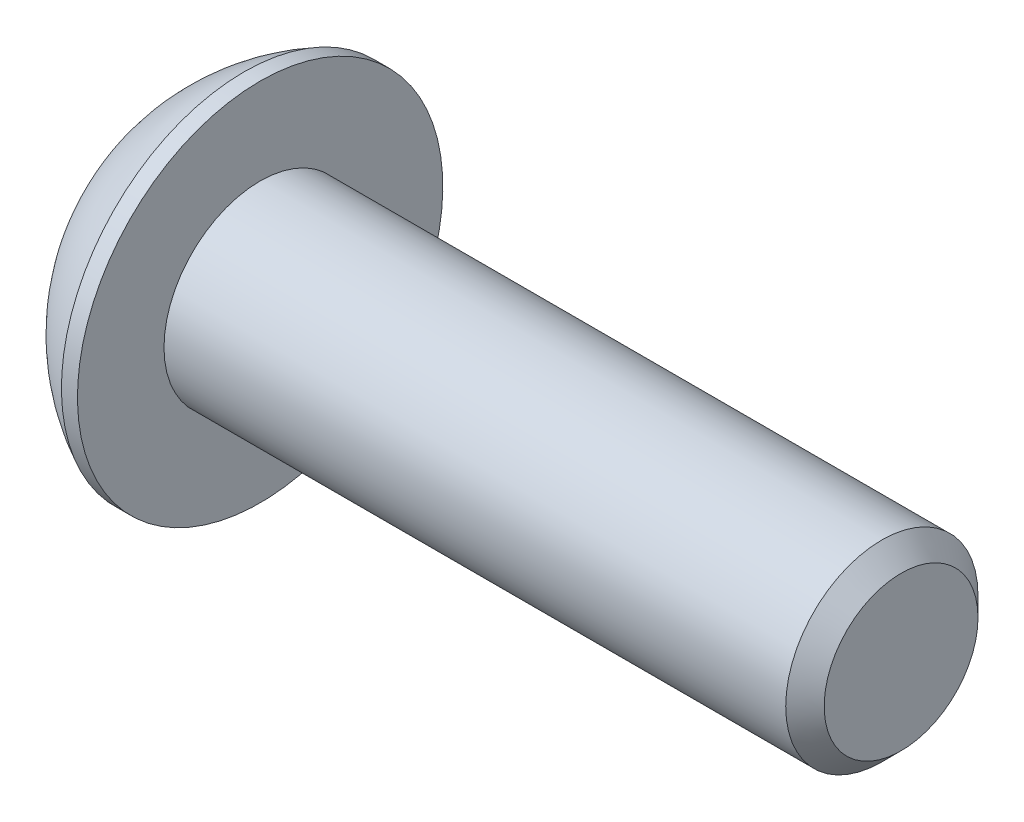
ISO-10303-21;
HEADER;
FILE_DESCRIPTION(('STEP AP214'),'2;1');
FILE_NAME('part.step','',(''),(''),'','','');
FILE_SCHEMA(('AUTOMOTIVE_DESIGN { 1 0 10303 214 1 1 1 1 }'));
ENDSEC;
DATA;
#1=APPLICATION_CONTEXT('core data for automotive mechanical design processes');
#2=APPLICATION_PROTOCOL_DEFINITION('international standard','automotive_design',2000,#1);
#3=PRODUCT_CONTEXT('',#1,'mechanical');
#4=PRODUCT('Part','Part','',(#3));
#5=PRODUCT_RELATED_PRODUCT_CATEGORY('part','',(#4));
#6=PRODUCT_DEFINITION_FORMATION('','',#4);
#7=PRODUCT_DEFINITION_CONTEXT('part definition',#1,'design');
#8=PRODUCT_DEFINITION('design','',#6,#7);
#9=PRODUCT_DEFINITION_SHAPE('','',#8);
#10=(LENGTH_UNIT() NAMED_UNIT(*) SI_UNIT(.MILLI.,.METRE.));
#11=(NAMED_UNIT(*) PLANE_ANGLE_UNIT() SI_UNIT($,.RADIAN.));
#12=(NAMED_UNIT(*) SI_UNIT($,.STERADIAN.) SOLID_ANGLE_UNIT());
#13=UNCERTAINTY_MEASURE_WITH_UNIT(LENGTH_MEASURE(1.E-05),#10,'distance_accuracy_value','');
#14=(GEOMETRIC_REPRESENTATION_CONTEXT(3) GLOBAL_UNCERTAINTY_ASSIGNED_CONTEXT((#13)) GLOBAL_UNIT_ASSIGNED_CONTEXT((#10,
#11,#12)) REPRESENTATION_CONTEXT('',''));
#15=CARTESIAN_POINT('',(0.,0.,0.));
#16=DIRECTION('',(0.,0.,1.));
#17=DIRECTION('',(1.,0.,0.));
#18=AXIS2_PLACEMENT_3D('',#15,#16,#17);
#19=CARTESIAN_POINT('',(-10.,0.,0.));
#20=DIRECTION('',(1.,0.,0.));
#21=DIRECTION('',(0.,0.,-1.));
#22=AXIS2_PLACEMENT_3D('',#19,#20,#21);
#23=CYLINDRICAL_SURFACE('',#22,1.5);
#24=CARTESIAN_POINT('',(-0.300000000000002,0.,0.));
#25=DIRECTION('',(1.,0.,0.));
#26=DIRECTION('',(0.,0.,-1.));
#27=AXIS2_PLACEMENT_3D('',#24,#25,#26);
#28=CIRCLE('',#27,1.5);
#29=CARTESIAN_POINT('',(-0.300000000000002,0.,-1.5));
#30=VERTEX_POINT('',#29);
#31=EDGE_CURVE('E45',#30,#30,#28,.F.);
#32=ORIENTED_EDGE('',*,*,#31,.T.);
#33=EDGE_LOOP('',(#32));
#34=FACE_BOUND('',#33,.T.);
#35=CARTESIAN_POINT('',(-10.,0.,0.));
#36=DIRECTION('',(1.,0.,0.));
#37=DIRECTION('',(0.,1.,0.));
#38=AXIS2_PLACEMENT_3D('',#35,#36,#37);
#39=CIRCLE('',#38,1.5);
#40=CARTESIAN_POINT('',(-10.,1.49999999999999,0.));
#41=VERTEX_POINT('',#40);
#42=EDGE_CURVE('E124',#41,#41,#39,.F.);
#43=ORIENTED_EDGE('',*,*,#42,.F.);
#44=EDGE_LOOP('',(#43));
#45=FACE_BOUND('',#44,.T.);
#46=ADVANCED_FACE('F32',(#34,#45),#23,.T.);
#47=CARTESIAN_POINT('',(0.,0.,0.));
#48=DIRECTION('',(1.,0.,0.));
#49=DIRECTION('',(0.,0.,-1.));
#50=AXIS2_PLACEMENT_3D('',#47,#48,#49);
#51=PLANE('',#50);
#52=CARTESIAN_POINT('',(0.,0.,0.));
#53=DIRECTION('',(1.,0.,0.));
#54=DIRECTION('',(0.,0.,-1.));
#55=AXIS2_PLACEMENT_3D('',#52,#53,#54);
#56=CIRCLE('',#55,1.2);
#57=CARTESIAN_POINT('',(0.,0.,-1.2));
#58=VERTEX_POINT('',#57);
#59=EDGE_CURVE('E127',#58,#58,#56,.T.);
#60=ORIENTED_EDGE('',*,*,#59,.T.);
#61=EDGE_LOOP('',(#60));
#62=FACE_BOUND('',#61,.T.);
#63=ADVANCED_FACE('F137',(#62),#51,.T.);
#64=CARTESIAN_POINT('',(0.,0.,0.));
#65=DIRECTION('',(-1.,0.,0.));
#66=DIRECTION('',(0.,0.,1.));
#67=AXIS2_PLACEMENT_3D('',#64,#65,#66);
#68=CONICAL_SURFACE('',#67,1.2,0.785398163397447);
#69=ORIENTED_EDGE('',*,*,#31,.F.);
#70=EDGE_LOOP('',(#69));
#71=FACE_BOUND('',#70,.T.);
#72=ORIENTED_EDGE('',*,*,#59,.F.);
#73=EDGE_LOOP('',(#72));
#74=FACE_BOUND('',#73,.T.);
#75=ADVANCED_FACE('F34',(#71,#74),#68,.T.);
#76=CARTESIAN_POINT('',(-11.65,0.,0.));
#77=DIRECTION('',(-1.,0.,0.));
#78=DIRECTION('',(0.,-1.,0.));
#79=AXIS2_PLACEMENT_3D('',#76,#77,#78);
#80=PLANE('',#79);
#81=CARTESIAN_POINT('',(-11.65,0.,0.));
#82=DIRECTION('',(-1.,0.,0.));
#83=DIRECTION('',(0.,-1.,0.));
#84=AXIS2_PLACEMENT_3D('',#81,#82,#83);
#85=CIRCLE('',#84,1.20470053837925);
#86=CARTESIAN_POINT('',(-11.65,-1.20470053837926,0.));
#87=VERTEX_POINT('',#86);
#88=EDGE_CURVE('E241',#87,#87,#85,.T.);
#89=ORIENTED_EDGE('',*,*,#88,.F.);
#90=EDGE_LOOP('',(#89));
#91=FACE_BOUND('',#90,.T.);
#92=CARTESIAN_POINT('',(-11.65,0.,0.));
#93=DIRECTION('',(1.,0.,0.));
#94=DIRECTION('',(0.,1.,0.));
#95=AXIS2_PLACEMENT_3D('',#92,#93,#94);
#96=CIRCLE('',#95,1.5);
#97=CARTESIAN_POINT('',(-11.65,1.5,0.));
#98=VERTEX_POINT('',#97);
#99=EDGE_CURVE('E121',#98,#98,#96,.T.);
#100=ORIENTED_EDGE('',*,*,#99,.F.);
#101=EDGE_LOOP('',(#100));
#102=FACE_BOUND('',#101,.T.);
#103=ADVANCED_FACE('F136',(#91,#102),#80,.T.);
#104=CARTESIAN_POINT('',(-8.85267857142857,0.,0.));
#105=DIRECTION('',(1.,0.,0.));
#106=DIRECTION('',(0.,1.,0.));
#107=AXIS2_PLACEMENT_3D('',#104,#105,#106);
#108=SPHERICAL_SURFACE('',#107,3.17411517981703);
#109=ORIENTED_EDGE('',*,*,#99,.T.);
#110=EDGE_LOOP('',(#109));
#111=FACE_BOUND('',#110,.T.);
#112=CARTESIAN_POINT('',(-10.25,0.,0.));
#113=DIRECTION('',(1.,0.,0.));
#114=DIRECTION('',(0.,1.,0.));
#115=AXIS2_PLACEMENT_3D('',#112,#113,#114);
#116=CIRCLE('',#115,2.85);
#117=CARTESIAN_POINT('',(-10.25,2.85,0.));
#118=VERTEX_POINT('',#117);
#119=EDGE_CURVE('E118',#118,#118,#116,.T.);
#120=ORIENTED_EDGE('',*,*,#119,.F.);
#121=EDGE_LOOP('',(#120));
#122=FACE_BOUND('',#121,.T.);
#123=ADVANCED_FACE('F148',(#111,#122),#108,.T.);
#124=CARTESIAN_POINT('',(-10.,0.,0.));
#125=DIRECTION('',(1.,0.,0.));
#126=DIRECTION('',(0.,1.,0.));
#127=AXIS2_PLACEMENT_3D('',#124,#125,#126);
#128=CYLINDRICAL_SURFACE('',#127,2.85);
#129=ORIENTED_EDGE('',*,*,#119,.T.);
#130=EDGE_LOOP('',(#129));
#131=FACE_BOUND('',#130,.T.);
#132=CARTESIAN_POINT('',(-10.,0.,0.));
#133=DIRECTION('',(1.,0.,0.));
#134=DIRECTION('',(0.,1.,0.));
#135=AXIS2_PLACEMENT_3D('',#132,#133,#134);
#136=CIRCLE('',#135,2.85);
#137=CARTESIAN_POINT('',(-10.,2.85,0.));
#138=VERTEX_POINT('',#137);
#139=EDGE_CURVE('E115',#138,#138,#136,.T.);
#140=ORIENTED_EDGE('',*,*,#139,.F.);
#141=EDGE_LOOP('',(#140));
#142=FACE_BOUND('',#141,.T.);
#143=ADVANCED_FACE('F152',(#131,#142),#128,.T.);
#144=CARTESIAN_POINT('',(-10.,2.85,0.));
#145=DIRECTION('',(1.,0.,0.));
#146=DIRECTION('',(0.,1.,0.));
#147=AXIS2_PLACEMENT_3D('',#144,#145,#146);
#148=PLANE('',#147);
#149=ORIENTED_EDGE('',*,*,#42,.T.);
#150=EDGE_LOOP('',(#149));
#151=FACE_BOUND('',#150,.T.);
#152=ORIENTED_EDGE('',*,*,#139,.T.);
#153=EDGE_LOOP('',(#152));
#154=FACE_BOUND('',#153,.T.);
#155=ADVANCED_FACE('F156',(#151,#154),#148,.T.);
#156=CARTESIAN_POINT('',(-11.65,0.,0.));
#157=DIRECTION('',(-1.,0.,0.));
#158=DIRECTION('',(0.,-1.,0.));
#159=AXIS2_PLACEMENT_3D('',#156,#157,#158);
#160=CONICAL_SURFACE('',#159,1.20470053837925,0.78539816339745);
#161=ORIENTED_EDGE('',*,*,#88,.T.);
#162=EDGE_LOOP('',(#161));
#163=FACE_BOUND('',#162,.T.);
#164=CARTESIAN_POINT('',(-12.0125645579163,-1.20678079288096,1.));
#165=CARTESIAN_POINT('',(-11.9901238799752,-1.17763239380938,1.));
#166=CARTESIAN_POINT('',(-11.9678867609271,-1.14832777655038,1.));
#167=CARTESIAN_POINT('',(-11.9239053230859,-1.0893407399734,1.));
#168=CARTESIAN_POINT('',(-11.902161120887,-1.05965823380996,1.));
#169=CARTESIAN_POINT('',(-11.8374858802222,-0.969511619364381,1.));
#170=CARTESIAN_POINT('',(-11.795456442765,-0.908390032886411,1.));
#171=CARTESIAN_POINT('',(-11.7124203349119,-0.779849899214036,1.));
#172=CARTESIAN_POINT('',(-11.6716484956871,-0.712278047733964,1.));
#173=CARTESIAN_POINT('',(-11.5967056855402,-0.573692441836181,1.));
#174=CARTESIAN_POINT('',(-11.5625124208036,-0.502691370033592,1.));
#175=CARTESIAN_POINT('',(-11.5206648240494,-0.39663310848367,1.));
#176=CARTESIAN_POINT('',(-11.5087524246011,-0.363265114723099,1.));
#177=CARTESIAN_POINT('',(-11.4876010580815,-0.295675144863695,1.));
#178=CARTESIAN_POINT('',(-11.4783622608543,-0.261453114661035,1.));
#179=CARTESIAN_POINT('',(-11.4632108375931,-0.192964714439429,1.));
#180=CARTESIAN_POINT('',(-11.4572372079353,-0.158712062702433,1.));
#181=CARTESIAN_POINT('',(-11.4487381792859,-0.0897678989597906,1.));
#182=CARTESIAN_POINT('',(-11.4462131691607,-0.0550763379077923,1.));
#183=CARTESIAN_POINT('',(-11.4448308242394,0.0128534343371999,1.));
#184=CARTESIAN_POINT('',(-11.4458171333425,0.0460884918414653,1.));
#185=CARTESIAN_POINT('',(-11.4510428296463,0.112288777523353,1.));
#186=CARTESIAN_POINT('',(-11.4552814228284,0.145254069576925,1.));
#187=CARTESIAN_POINT('',(-11.4668431932388,0.211252641710471,1.));
#188=CARTESIAN_POINT('',(-11.4742213991969,0.244276126106415,1.));
#189=CARTESIAN_POINT('',(-11.4916537633013,0.309593416178904,1.));
#190=CARTESIAN_POINT('',(-11.5017077720937,0.341887262472134,1.));
#191=CARTESIAN_POINT('',(-11.5364692676108,0.441188556116712,1.));
#192=CARTESIAN_POINT('',(-11.5650343603337,0.506841480843483,1.));
#193=CARTESIAN_POINT('',(-11.6286033694253,0.63508138921237,1.));
#194=CARTESIAN_POINT('',(-11.663629955309,0.69765656406953,1.));
#195=CARTESIAN_POINT('',(-11.7359546107891,0.81727436969462,1.));
#196=CARTESIAN_POINT('',(-11.7730556162911,0.874437672313588,1.));
#197=CARTESIAN_POINT('',(-11.8304371678966,0.958655710303492,1.));
#198=CARTESIAN_POINT('',(-11.8497720189249,0.986366163766959,1.));
#199=CARTESIAN_POINT('',(-11.8889602713879,1.0414069197441,1.));
#200=CARTESIAN_POINT('',(-11.908813529201,1.06873732439882,1.));
#201=CARTESIAN_POINT('',(-11.92888195229,1.0959092145887,1.));
#202=B_SPLINE_CURVE_WITH_KNOTS('',3,(#164,#165,#166,#167,#168,#169,#170,#171,#172,#173,#174,
#175,#176,#177,#178,#179,#180,#181,#182,#183,#184,#185,#186,#187,#188,#189,#190,#191,#192,#193,
#194,#195,#196,#197,#198,#199,#200,#201),.UNSPECIFIED.,.F.,.F.,(4,2,2,2,2,2,2,2,2,2,2,2,2,2,2,2,
2,2,4),(0.,0.110355487284534,0.220736811203825,0.443178348562911,0.679759335181116,
0.915523888816462,1.02172703810024,1.1279369325962,1.23208803653002,1.33625088357217,
1.43583459192535,1.53539399546241,1.63677534642523,1.73815103982915,1.95232008261278,
2.16725532249797,2.37159620059983,2.47295962852456,2.57429526618464),.UNSPECIFIED.);
#203=CARTESIAN_POINT('',(-11.6,-0.577350269189633,1.));
#204=VERTEX_POINT('',#203);
#205=CARTESIAN_POINT('',(-11.6,0.57735026918962,1.));
#206=VERTEX_POINT('',#205);
#207=EDGE_CURVE('E99',#204,#206,#202,.T.);
#208=ORIENTED_EDGE('',*,*,#207,.F.);
#209=CARTESIAN_POINT('',(-11.6001154873726,-1.1548160084331,-0.000200000000000086));
#210=CARTESIAN_POINT('',(-11.5802779308257,-1.13496520795026,0.0341825950071808));
#211=CARTESIAN_POINT('',(-11.5616050206389,-1.11478247255943,0.069140118139825));
#212=CARTESIAN_POINT('',(-11.5274147427232,-1.0736273952922,0.14042280295609));
#213=CARTESIAN_POINT('',(-11.5119164090235,-1.0526511355808,0.176754750528984));
#214=CARTESIAN_POINT('',(-11.4853673071423,-1.01035337909804,0.250016613803311));
#215=CARTESIAN_POINT('',(-11.4742497739969,-0.989042666109248,0.286927851445414));
#216=CARTESIAN_POINT('',(-11.4571198657762,-0.945952199282699,0.361562729310858));
#217=CARTESIAN_POINT('',(-11.4510946974667,-0.924173762626604,0.399284088108635));
#218=CARTESIAN_POINT('',(-11.4456605549675,-0.886641312640022,0.464292198417933));
#219=CARTESIAN_POINT('',(-11.4448569383167,-0.870936130672283,0.491494371528171));
#220=CARTESIAN_POINT('',(-11.4462066994169,-0.839556179862856,0.545846040669111));
#221=CARTESIAN_POINT('',(-11.4483607295472,-0.823881418494931,0.572995523754875));
#222=CARTESIAN_POINT('',(-11.4591169721285,-0.777080970599374,0.654056277326959));
#223=CARTESIAN_POINT('',(-11.4720145564154,-0.746188191116438,0.707564140978427));
#224=CARTESIAN_POINT('',(-11.5031407306022,-0.691968116419657,0.801476065143431));
#225=CARTESIAN_POINT('',(-11.5197377977018,-0.668386557293379,0.842320523671833));
#226=CARTESIAN_POINT('',(-11.5571249246853,-0.622147085933689,0.922409637381943));
#227=CARTESIAN_POINT('',(-11.5779013418174,-0.599486449584583,0.961659010870437));
#228=CARTESIAN_POINT('',(-11.6001154873726,-0.577234799135795,1.0002));
#229=B_SPLINE_CURVE_WITH_KNOTS('',3,(#209,#210,#211,#212,#213,#214,#215,#216,#217,#218,#219,
#220,#221,#222,#223,#224,#225,#226,#227,#228),.UNSPECIFIED.,.F.,.F.,(4,2,2,2,2,2,2,2,2,4),(0.,
0.133237676828559,0.26725222983449,0.399137076269299,0.530689603280767,0.624814864263845,
0.718960890149132,0.907306626112096,1.05710100361789,1.20641411519286),.UNSPECIFIED.);
#230=CARTESIAN_POINT('',(-11.6,-1.15470053837926,0.));
#231=VERTEX_POINT('',#230);
#232=EDGE_CURVE('E198',#231,#204,#229,.T.);
#233=ORIENTED_EDGE('',*,*,#232,.F.);
#234=CARTESIAN_POINT('',(-11.6001154873726,-0.577234799135795,-1.0002));
#235=CARTESIAN_POINT('',(-11.5802779308257,-0.597085599618629,-0.965817404992819));
#236=CARTESIAN_POINT('',(-11.5616050206389,-0.617268335009463,-0.930859881860175));
#237=CARTESIAN_POINT('',(-11.5274147427232,-0.658423412276693,-0.85957719704391));
#238=CARTESIAN_POINT('',(-11.5119164090235,-0.679399671988087,-0.823245249471016));
#239=CARTESIAN_POINT('',(-11.4853673071423,-0.721697428470853,-0.749983386196689));
#240=CARTESIAN_POINT('',(-11.4742497739969,-0.743008141459643,-0.713072148554586));
#241=CARTESIAN_POINT('',(-11.4571198657762,-0.786098608286193,-0.638437270689141));
#242=CARTESIAN_POINT('',(-11.4510946974667,-0.807877044942288,-0.600715911891365));
#243=CARTESIAN_POINT('',(-11.4456605549675,-0.845409494928869,-0.535707801582067));
#244=CARTESIAN_POINT('',(-11.4448569383167,-0.861114676896608,-0.508505628471829));
#245=CARTESIAN_POINT('',(-11.4462066994169,-0.892494627706036,-0.454153959330889));
#246=CARTESIAN_POINT('',(-11.4483607295472,-0.90816938907396,-0.427004476245125));
#247=CARTESIAN_POINT('',(-11.4591169721285,-0.954969836969517,-0.34594372267304));
#248=CARTESIAN_POINT('',(-11.4720145564154,-0.985862616452454,-0.292435859021573));
#249=CARTESIAN_POINT('',(-11.5031407306022,-1.04008269114923,-0.198523934856569));
#250=CARTESIAN_POINT('',(-11.5197377977018,-1.06366425027551,-0.157679476328166));
#251=CARTESIAN_POINT('',(-11.5571249246853,-1.1099037216352,-0.0775903626180562));
#252=CARTESIAN_POINT('',(-11.5779013418174,-1.13256435798431,-0.0383409891295623));
#253=CARTESIAN_POINT('',(-11.6001154873726,-1.1548160084331,0.000199999999999825));
#254=B_SPLINE_CURVE_WITH_KNOTS('',3,(#234,#235,#236,#237,#238,#239,#240,#241,#242,#243,#244,
#245,#246,#247,#248,#249,#250,#251,#252,#253),.UNSPECIFIED.,.F.,.F.,(4,2,2,2,2,2,2,2,2,4),(0.,
0.133237676828559,0.267252229834489,0.399137076269299,0.530689603280767,0.624814864263845,
0.718960890149132,0.907306626112096,1.05710100361789,1.20641411519286),.UNSPECIFIED.);
#255=CARTESIAN_POINT('',(-11.6,-0.577350269189633,-1.));
#256=VERTEX_POINT('',#255);
#257=EDGE_CURVE('E193',#256,#231,#254,.T.);
#258=ORIENTED_EDGE('',*,*,#257,.F.);
#259=CARTESIAN_POINT('',(-12.0125645579163,-1.20678079288096,-1.));
#260=CARTESIAN_POINT('',(-11.9901238799752,-1.17763239380938,-1.));
#261=CARTESIAN_POINT('',(-11.9678867609271,-1.14832777655038,-1.));
#262=CARTESIAN_POINT('',(-11.9239053230859,-1.0893407399734,-1.));
#263=CARTESIAN_POINT('',(-11.902161120887,-1.05965823380996,-1.));
#264=CARTESIAN_POINT('',(-11.8374858802222,-0.969511619364381,-1.));
#265=CARTESIAN_POINT('',(-11.795456442765,-0.908390032886411,-1.));
#266=CARTESIAN_POINT('',(-11.7124203349119,-0.779849899214036,-1.));
#267=CARTESIAN_POINT('',(-11.6716484956871,-0.712278047733964,-1.));
#268=CARTESIAN_POINT('',(-11.5967056855402,-0.573692441836181,-1.));
#269=CARTESIAN_POINT('',(-11.5625124208036,-0.502691370033592,-1.));
#270=CARTESIAN_POINT('',(-11.5206648240494,-0.39663310848367,-1.));
#271=CARTESIAN_POINT('',(-11.5087524246011,-0.363265114723098,-1.));
#272=CARTESIAN_POINT('',(-11.4876010580815,-0.295675144863695,-1.));
#273=CARTESIAN_POINT('',(-11.4783622608543,-0.261453114661034,-1.));
#274=CARTESIAN_POINT('',(-11.4632108375931,-0.192964714439429,-1.));
#275=CARTESIAN_POINT('',(-11.4572372079353,-0.158712062702433,-1.));
#276=CARTESIAN_POINT('',(-11.4487381792859,-0.0897678989597913,-1.));
#277=CARTESIAN_POINT('',(-11.4462131691607,-0.0550763379077931,-1.));
#278=CARTESIAN_POINT('',(-11.4448308242394,0.0128534343371989,-1.));
#279=CARTESIAN_POINT('',(-11.4458171333425,0.0460884918414642,-1.));
#280=CARTESIAN_POINT('',(-11.4510428296463,0.112288777523352,-1.));
#281=CARTESIAN_POINT('',(-11.4552814228284,0.145254069576924,-1.));
#282=CARTESIAN_POINT('',(-11.4668431932388,0.211252641710471,-1.));
#283=CARTESIAN_POINT('',(-11.4742213991969,0.244276126106414,-1.));
#284=CARTESIAN_POINT('',(-11.4916537633013,0.309593416178904,-1.));
#285=CARTESIAN_POINT('',(-11.5017077720937,0.341887262472134,-1.));
#286=CARTESIAN_POINT('',(-11.5364692676108,0.441188556116712,-1.));
#287=CARTESIAN_POINT('',(-11.5650343603337,0.506841480843484,-1.));
#288=CARTESIAN_POINT('',(-11.6286033694253,0.63508138921237,-1.));
#289=CARTESIAN_POINT('',(-11.663629955309,0.69765656406953,-1.));
#290=CARTESIAN_POINT('',(-11.7359546107891,0.81727436969462,-1.));
#291=CARTESIAN_POINT('',(-11.7730556162911,0.874437672313588,-1.));
#292=CARTESIAN_POINT('',(-11.8304371678966,0.958655710303492,-1.));
#293=CARTESIAN_POINT('',(-11.8497720189249,0.986366163766959,-1.));
#294=CARTESIAN_POINT('',(-11.8889602713879,1.0414069197441,-1.));
#295=CARTESIAN_POINT('',(-11.908813529201,1.06873732439882,-1.));
#296=CARTESIAN_POINT('',(-11.92888195229,1.0959092145887,-1.));
#297=B_SPLINE_CURVE_WITH_KNOTS('',3,(#259,#260,#261,#262,#263,#264,#265,#266,#267,#268,#269,
#270,#271,#272,#273,#274,#275,#276,#277,#278,#279,#280,#281,#282,#283,#284,#285,#286,#287,#288,
#289,#290,#291,#292,#293,#294,#295,#296),.UNSPECIFIED.,.F.,.F.,(4,2,2,2,2,2,2,2,2,2,2,2,2,2,2,2,
2,2,4),(0.,0.110355487284535,0.220736811203825,0.443178348562912,0.679759335181115,
0.915523888816463,1.02172703810025,1.1279369325962,1.23208803653002,1.33625088357217,
1.43583459192535,1.53539399546241,1.63677534642523,1.73815103982915,1.95232008261278,
2.16725532249797,2.37159620059983,2.47295962852456,2.57429526618464),.UNSPECIFIED.);
#298=CARTESIAN_POINT('',(-11.6,0.577350269189619,-1.));
#299=VERTEX_POINT('',#298);
#300=EDGE_CURVE('E52',#299,#256,#297,.F.);
#301=ORIENTED_EDGE('',*,*,#300,.F.);
#302=CARTESIAN_POINT('',(-11.6001154873726,1.15481600843308,0.000199999999999967));
#303=CARTESIAN_POINT('',(-11.5802779308257,1.13496520795025,-0.0341825950071808));
#304=CARTESIAN_POINT('',(-11.5616050206389,1.11478247255941,-0.0691401181398251));
#305=CARTESIAN_POINT('',(-11.5274147427232,1.07362739529218,-0.14042280295609));
#306=CARTESIAN_POINT('',(-11.5119164090235,1.05265113558079,-0.176754750528985));
#307=CARTESIAN_POINT('',(-11.4853673071423,1.01035337909802,-0.250016613803313));
#308=CARTESIAN_POINT('',(-11.4742497739969,0.989042666109233,-0.286927851445416));
#309=CARTESIAN_POINT('',(-11.4571198657762,0.945952199282684,-0.361562729310861));
#310=CARTESIAN_POINT('',(-11.4510946974667,0.924173762626589,-0.399284088108637));
#311=CARTESIAN_POINT('',(-11.4456605549675,0.886641312640007,-0.464292198417935));
#312=CARTESIAN_POINT('',(-11.4448569383167,0.870936130672268,-0.491494371528174));
#313=CARTESIAN_POINT('',(-11.4462066994169,0.839556179862841,-0.545846040669114));
#314=CARTESIAN_POINT('',(-11.4483607295472,0.823881418494916,-0.572995523754877));
#315=CARTESIAN_POINT('',(-11.4591169721285,0.777080970599359,-0.654056277326962));
#316=CARTESIAN_POINT('',(-11.4720145564154,0.746188191116423,-0.707564140978429));
#317=CARTESIAN_POINT('',(-11.5031407306022,0.691968116419642,-0.801476065143433));
#318=CARTESIAN_POINT('',(-11.5197377977018,0.668386557293364,-0.842320523671835));
#319=CARTESIAN_POINT('',(-11.5571249246853,0.622147085933675,-0.922409637381944));
#320=CARTESIAN_POINT('',(-11.5779013418174,0.599486449584569,-0.961659010870438));
#321=CARTESIAN_POINT('',(-11.6001154873726,0.577234799135782,-1.0002));
#322=B_SPLINE_CURVE_WITH_KNOTS('',3,(#302,#303,#304,#305,#306,#307,#308,#309,#310,#311,#312,
#313,#314,#315,#316,#317,#318,#319,#320,#321),.UNSPECIFIED.,.F.,.F.,(4,2,2,2,2,2,2,2,2,4),(0.,
0.133237676828559,0.267252229834492,0.399137076269302,0.53068960328077,0.624814864263848,
0.718960890149135,0.9073066261121,1.05710100361789,1.20641411519286),.UNSPECIFIED.);
#323=CARTESIAN_POINT('',(-11.6,1.15470053837925,0.));
#324=VERTEX_POINT('',#323);
#325=EDGE_CURVE('E11',#324,#299,#322,.T.);
#326=ORIENTED_EDGE('',*,*,#325,.F.);
#327=CARTESIAN_POINT('',(-11.6001154873726,0.577234799135782,1.0002));
#328=CARTESIAN_POINT('',(-11.5802779308257,0.597085599618615,0.965817404992819));
#329=CARTESIAN_POINT('',(-11.5616050206389,0.61726833500945,0.930859881860174));
#330=CARTESIAN_POINT('',(-11.5274147427232,0.65842341227668,0.85957719704391));
#331=CARTESIAN_POINT('',(-11.5119164090235,0.679399671988073,0.823245249471016));
#332=CARTESIAN_POINT('',(-11.4853673071423,0.72169742847084,0.749983386196689));
#333=CARTESIAN_POINT('',(-11.4742497739969,0.74300814145963,0.713072148554586));
#334=CARTESIAN_POINT('',(-11.4571198657762,0.786098608286179,0.638437270689142));
#335=CARTESIAN_POINT('',(-11.4510946974667,0.807877044942274,0.600715911891365));
#336=CARTESIAN_POINT('',(-11.4456605549675,0.845409494928856,0.535707801582068));
#337=CARTESIAN_POINT('',(-11.4448569383167,0.861114676896595,0.508505628471829));
#338=CARTESIAN_POINT('',(-11.4462066994169,0.892494627706022,0.454153959330889));
#339=CARTESIAN_POINT('',(-11.4483607295472,0.908169389073947,0.427004476245125));
#340=CARTESIAN_POINT('',(-11.4591169721285,0.954969836969504,0.345943722673041));
#341=CARTESIAN_POINT('',(-11.4720145564154,0.98586261645244,0.292435859021574));
#342=CARTESIAN_POINT('',(-11.5031407306022,1.04008269114922,0.19852393485657));
#343=CARTESIAN_POINT('',(-11.5197377977018,1.0636642502755,0.157679476328167));
#344=CARTESIAN_POINT('',(-11.5571249246853,1.10990372163519,0.0775903626180577));
#345=CARTESIAN_POINT('',(-11.5779013418174,1.1325643579843,0.0383409891295633));
#346=CARTESIAN_POINT('',(-11.6001154873726,1.15481600843308,-0.000199999999999447));
#347=B_SPLINE_CURVE_WITH_KNOTS('',3,(#327,#328,#329,#330,#331,#332,#333,#334,#335,#336,#337,
#338,#339,#340,#341,#342,#343,#344,#345,#346),.UNSPECIFIED.,.F.,.F.,(4,2,2,2,2,2,2,2,2,4),(0.,
0.133237676828559,0.267252229834489,0.399137076269298,0.530689603280766,0.624814864263844,
0.718960890149131,0.907306626112095,1.05710100361789,1.20641411519286),.UNSPECIFIED.);
#348=EDGE_CURVE('E90',#206,#324,#347,.T.);
#349=ORIENTED_EDGE('',*,*,#348,.F.);
#350=EDGE_LOOP('',(#208,#233,#258,#301,#326,#349));
#351=FACE_BOUND('',#350,.T.);
#352=ADVANCED_FACE('F89',(#163,#351),#160,.F.);
#353=CARTESIAN_POINT('',(-10.45,0.,0.));
#354=DIRECTION('',(-1.,0.,0.));
#355=DIRECTION('',(0.,0.,1.));
#356=AXIS2_PLACEMENT_3D('',#353,#354,#355);
#357=PLANE('',#356);
#358=DIRECTION('',(0.,0.5,-0.866025403784439));
#359=VECTOR('',#358,1.);
#360=CARTESIAN_POINT('',(-10.45,0.577350269189619,1.));
#361=LINE('',#360,#359);
#362=CARTESIAN_POINT('',(-10.45,0.577350269189619,1.));
#363=VERTEX_POINT('',#362);
#364=CARTESIAN_POINT('',(-10.45,1.15470053837925,0.));
#365=VERTEX_POINT('',#364);
#366=EDGE_CURVE('E98',#363,#365,#361,.T.);
#367=ORIENTED_EDGE('',*,*,#366,.T.);
#368=DIRECTION('',(0.,-0.5,-0.866025403784439));
#369=VECTOR('',#368,1.);
#370=CARTESIAN_POINT('',(-10.45,1.15470053837925,0.));
#371=LINE('',#370,#369);
#372=CARTESIAN_POINT('',(-10.45,0.577350269189619,-1.));
#373=VERTEX_POINT('',#372);
#374=EDGE_CURVE('E103',#365,#373,#371,.T.);
#375=ORIENTED_EDGE('',*,*,#374,.T.);
#376=DIRECTION('',(0.,-1.,0.));
#377=VECTOR('',#376,1.);
#378=CARTESIAN_POINT('',(-10.45,0.577350269189619,-1.));
#379=LINE('',#378,#377);
#380=CARTESIAN_POINT('',(-10.45,-0.577350269189633,-1.));
#381=VERTEX_POINT('',#380);
#382=EDGE_CURVE('E223',#373,#381,#379,.T.);
#383=ORIENTED_EDGE('',*,*,#382,.T.);
#384=DIRECTION('',(0.,-0.5,0.866025403784439));
#385=VECTOR('',#384,1.);
#386=CARTESIAN_POINT('',(-10.45,-0.577350269189633,-1.));
#387=LINE('',#386,#385);
#388=CARTESIAN_POINT('',(-10.45,-1.15470053837926,0.));
#389=VERTEX_POINT('',#388);
#390=EDGE_CURVE('E227',#381,#389,#387,.T.);
#391=ORIENTED_EDGE('',*,*,#390,.T.);
#392=DIRECTION('',(0.,0.5,0.866025403784439));
#393=VECTOR('',#392,1.);
#394=CARTESIAN_POINT('',(-10.45,-1.15470053837926,0.));
#395=LINE('',#394,#393);
#396=CARTESIAN_POINT('',(-10.45,-0.577350269189633,1.));
#397=VERTEX_POINT('',#396);
#398=EDGE_CURVE('E111',#389,#397,#395,.T.);
#399=ORIENTED_EDGE('',*,*,#398,.T.);
#400=DIRECTION('',(0.,1.,0.));
#401=VECTOR('',#400,1.);
#402=CARTESIAN_POINT('',(-10.45,-0.577350269189633,1.));
#403=LINE('',#402,#401);
#404=EDGE_CURVE('E106',#397,#363,#403,.T.);
#405=ORIENTED_EDGE('',*,*,#404,.T.);
#406=EDGE_LOOP('',(#367,#375,#383,#391,#399,#405));
#407=FACE_BOUND('',#406,.T.);
#408=ADVANCED_FACE('F180',(#407),#357,.T.);
#409=CARTESIAN_POINT('',(-10.45,1.15470053837925,0.));
#410=DIRECTION('',(0.,0.866025403784439,-0.5));
#411=DIRECTION('',(0.,0.5,0.866025403784439));
#412=AXIS2_PLACEMENT_3D('',#409,#410,#411);
#413=PLANE('',#412);
#414=DIRECTION('',(-1.,0.,0.));
#415=VECTOR('',#414,1.);
#416=CARTESIAN_POINT('',(-10.45,1.15470053837925,0.));
#417=LINE('',#416,#415);
#418=EDGE_CURVE('E96',#365,#324,#417,.T.);
#419=ORIENTED_EDGE('',*,*,#418,.T.);
#420=ORIENTED_EDGE('',*,*,#325,.T.);
#421=DIRECTION('',(-1.,0.,0.));
#422=VECTOR('',#421,1.);
#423=CARTESIAN_POINT('',(-10.45,0.577350269189619,-1.));
#424=LINE('',#423,#422);
#425=EDGE_CURVE('E105',#373,#299,#424,.T.);
#426=ORIENTED_EDGE('',*,*,#425,.F.);
#427=ORIENTED_EDGE('',*,*,#374,.F.);
#428=EDGE_LOOP('',(#419,#420,#426,#427));
#429=FACE_BOUND('',#428,.T.);
#430=ADVANCED_FACE('F101',(#429),#413,.F.);
#431=CARTESIAN_POINT('',(-10.45,0.577350269189619,-1.));
#432=DIRECTION('',(0.,0.,-1.));
#433=DIRECTION('',(-1.,0.,0.));
#434=AXIS2_PLACEMENT_3D('',#431,#432,#433);
#435=PLANE('',#434);
#436=ORIENTED_EDGE('',*,*,#425,.T.);
#437=ORIENTED_EDGE('',*,*,#300,.T.);
#438=DIRECTION('',(-1.,0.,0.));
#439=VECTOR('',#438,1.);
#440=CARTESIAN_POINT('',(-10.45,-0.577350269189633,-1.));
#441=LINE('',#440,#439);
#442=EDGE_CURVE('E108',#381,#256,#441,.T.);
#443=ORIENTED_EDGE('',*,*,#442,.F.);
#444=ORIENTED_EDGE('',*,*,#382,.F.);
#445=EDGE_LOOP('',(#436,#437,#443,#444));
#446=FACE_BOUND('',#445,.T.);
#447=ADVANCED_FACE('F212',(#446),#435,.F.);
#448=CARTESIAN_POINT('',(-10.45,-0.577350269189633,-1.));
#449=DIRECTION('',(0.,-0.866025403784439,-0.5));
#450=DIRECTION('',(0.,0.5,-0.866025403784439));
#451=AXIS2_PLACEMENT_3D('',#448,#449,#450);
#452=PLANE('',#451);
#453=ORIENTED_EDGE('',*,*,#442,.T.);
#454=ORIENTED_EDGE('',*,*,#257,.T.);
#455=DIRECTION('',(-1.,0.,0.));
#456=VECTOR('',#455,1.);
#457=CARTESIAN_POINT('',(-10.45,-1.15470053837926,0.));
#458=LINE('',#457,#456);
#459=EDGE_CURVE('E237',#389,#231,#458,.T.);
#460=ORIENTED_EDGE('',*,*,#459,.F.);
#461=ORIENTED_EDGE('',*,*,#390,.F.);
#462=EDGE_LOOP('',(#453,#454,#460,#461));
#463=FACE_BOUND('',#462,.T.);
#464=ADVANCED_FACE('F207',(#463),#452,.F.);
#465=CARTESIAN_POINT('',(-10.45,-1.15470053837926,0.));
#466=DIRECTION('',(0.,-0.866025403784439,0.5));
#467=DIRECTION('',(0.,-0.5,-0.866025403784439));
#468=AXIS2_PLACEMENT_3D('',#465,#466,#467);
#469=PLANE('',#468);
#470=ORIENTED_EDGE('',*,*,#459,.T.);
#471=ORIENTED_EDGE('',*,*,#232,.T.);
#472=DIRECTION('',(-1.,0.,0.));
#473=VECTOR('',#472,1.);
#474=CARTESIAN_POINT('',(-10.45,-0.577350269189633,1.));
#475=LINE('',#474,#473);
#476=EDGE_CURVE('E234',#397,#204,#475,.T.);
#477=ORIENTED_EDGE('',*,*,#476,.F.);
#478=ORIENTED_EDGE('',*,*,#398,.F.);
#479=EDGE_LOOP('',(#470,#471,#477,#478));
#480=FACE_BOUND('',#479,.T.);
#481=ADVANCED_FACE('F204',(#480),#469,.F.);
#482=CARTESIAN_POINT('',(-10.45,-0.577350269189633,1.));
#483=DIRECTION('',(0.,0.,1.));
#484=DIRECTION('',(1.,0.,0.));
#485=AXIS2_PLACEMENT_3D('',#482,#483,#484);
#486=PLANE('',#485);
#487=ORIENTED_EDGE('',*,*,#476,.T.);
#488=ORIENTED_EDGE('',*,*,#207,.T.);
#489=DIRECTION('',(-1.,0.,0.));
#490=VECTOR('',#489,1.);
#491=CARTESIAN_POINT('',(-10.45,0.577350269189619,1.));
#492=LINE('',#491,#490);
#493=EDGE_CURVE('E59',#363,#206,#492,.T.);
#494=ORIENTED_EDGE('',*,*,#493,.F.);
#495=ORIENTED_EDGE('',*,*,#404,.F.);
#496=EDGE_LOOP('',(#487,#488,#494,#495));
#497=FACE_BOUND('',#496,.T.);
#498=ADVANCED_FACE('F163',(#497),#486,.F.);
#499=CARTESIAN_POINT('',(-10.45,0.577350269189619,1.));
#500=DIRECTION('',(0.,0.866025403784439,0.5));
#501=DIRECTION('',(0.,-0.5,0.866025403784439));
#502=AXIS2_PLACEMENT_3D('',#499,#500,#501);
#503=PLANE('',#502);
#504=ORIENTED_EDGE('',*,*,#493,.T.);
#505=ORIENTED_EDGE('',*,*,#348,.T.);
#506=ORIENTED_EDGE('',*,*,#418,.F.);
#507=ORIENTED_EDGE('',*,*,#366,.F.);
#508=EDGE_LOOP('',(#504,#505,#506,#507));
#509=FACE_BOUND('',#508,.T.);
#510=ADVANCED_FACE('F95',(#509),#503,.F.);
#511=CLOSED_SHELL('',(#46,#63,#75,#103,#123,#143,#155,#352,#408,#430,#447,#464,#481,#498,#510));
#512=MANIFOLD_SOLID_BREP('B2',#511);
#513=ADVANCED_BREP_SHAPE_REPRESENTATION('',(#18,#512),#14);
#514=SHAPE_DEFINITION_REPRESENTATION(#9,#513);
ENDSEC;
END-ISO-10303-21;
